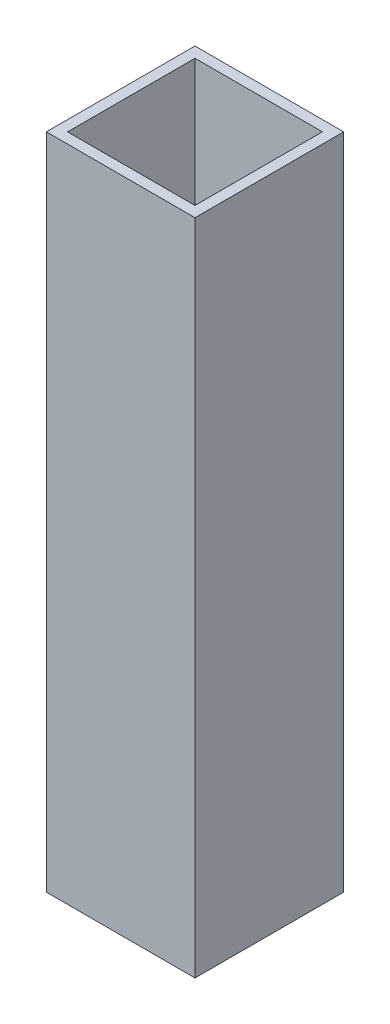
ISO-10303-21;
HEADER;
FILE_DESCRIPTION(('STEP AP214'),'2;1');
FILE_NAME('part.step','',(''),(''),'','','');
FILE_SCHEMA(('AUTOMOTIVE_DESIGN { 1 0 10303 214 1 1 1 1 }'));
ENDSEC;
DATA;
#1=APPLICATION_CONTEXT('core data for automotive mechanical design processes');
#2=APPLICATION_PROTOCOL_DEFINITION('international standard','automotive_design',2000,#1);
#3=PRODUCT_CONTEXT('',#1,'mechanical');
#4=PRODUCT('Part','Part','',(#3));
#5=PRODUCT_RELATED_PRODUCT_CATEGORY('part','',(#4));
#6=PRODUCT_DEFINITION_FORMATION('','',#4);
#7=PRODUCT_DEFINITION_CONTEXT('part definition',#1,'design');
#8=PRODUCT_DEFINITION('design','',#6,#7);
#9=PRODUCT_DEFINITION_SHAPE('','',#8);
#10=(LENGTH_UNIT() NAMED_UNIT(*) SI_UNIT(.MILLI.,.METRE.));
#11=(NAMED_UNIT(*) PLANE_ANGLE_UNIT() SI_UNIT($,.RADIAN.));
#12=(NAMED_UNIT(*) SI_UNIT($,.STERADIAN.) SOLID_ANGLE_UNIT());
#13=UNCERTAINTY_MEASURE_WITH_UNIT(LENGTH_MEASURE(1.E-05),#10,'distance_accuracy_value','');
#14=(GEOMETRIC_REPRESENTATION_CONTEXT(3) GLOBAL_UNCERTAINTY_ASSIGNED_CONTEXT((#13)) GLOBAL_UNIT_ASSIGNED_CONTEXT((#10,
#11,#12)) REPRESENTATION_CONTEXT('',''));
#15=CARTESIAN_POINT('',(0.,0.,0.));
#16=DIRECTION('',(0.,0.,1.));
#17=DIRECTION('',(1.,0.,0.));
#18=AXIS2_PLACEMENT_3D('',#15,#16,#17);
#19=CARTESIAN_POINT('',(0.,196.85,0.));
#20=DIRECTION('',(0.,-1.,0.));
#21=DIRECTION('',(0.,0.,-1.));
#22=AXIS2_PLACEMENT_3D('',#19,#20,#21);
#23=PLANE('',#22);
#24=DIRECTION('',(0.,0.,1.));
#25=VECTOR('',#24,1.);
#26=CARTESIAN_POINT('',(0.,196.85,0.));
#27=LINE('',#26,#25);
#28=CARTESIAN_POINT('',(0.,196.85,-44.45));
#29=VERTEX_POINT('',#28);
#30=CARTESIAN_POINT('',(0.,196.85,0.));
#31=VERTEX_POINT('',#30);
#32=EDGE_CURVE('E138',#29,#31,#27,.T.);
#33=ORIENTED_EDGE('',*,*,#32,.T.);
#34=DIRECTION('',(1.,0.,0.));
#35=VECTOR('',#34,1.);
#36=CARTESIAN_POINT('',(0.,196.85,0.));
#37=LINE('',#36,#35);
#38=CARTESIAN_POINT('',(44.45,196.85,0.));
#39=VERTEX_POINT('',#38);
#40=EDGE_CURVE('E141',#31,#39,#37,.T.);
#41=ORIENTED_EDGE('',*,*,#40,.T.);
#42=DIRECTION('',(0.,0.,-1.));
#43=VECTOR('',#42,1.);
#44=CARTESIAN_POINT('',(44.45,196.85,0.));
#45=LINE('',#44,#43);
#46=CARTESIAN_POINT('',(44.45,196.85,-44.45));
#47=VERTEX_POINT('',#46);
#48=EDGE_CURVE('E144',#39,#47,#45,.T.);
#49=ORIENTED_EDGE('',*,*,#48,.T.);
#50=DIRECTION('',(-1.,0.,0.));
#51=VECTOR('',#50,1.);
#52=CARTESIAN_POINT('',(0.,196.85,-44.45));
#53=LINE('',#52,#51);
#54=EDGE_CURVE('E146',#47,#29,#53,.T.);
#55=ORIENTED_EDGE('',*,*,#54,.T.);
#56=EDGE_LOOP('',(#33,#41,#49,#55));
#57=FACE_BOUND('',#56,.T.);
#58=DIRECTION('',(1.,0.,0.));
#59=VECTOR('',#58,1.);
#60=CARTESIAN_POINT('',(3.175,196.85,-3.175));
#61=LINE('',#60,#59);
#62=CARTESIAN_POINT('',(3.175,196.85,-3.175));
#63=VERTEX_POINT('',#62);
#64=CARTESIAN_POINT('',(41.275,196.85,-3.175));
#65=VERTEX_POINT('',#64);
#66=EDGE_CURVE('E102',#63,#65,#61,.T.);
#67=ORIENTED_EDGE('',*,*,#66,.F.);
#68=DIRECTION('',(0.,0.,1.));
#69=VECTOR('',#68,1.);
#70=CARTESIAN_POINT('',(3.175,196.85,-3.175));
#71=LINE('',#70,#69);
#72=CARTESIAN_POINT('',(3.175,196.85,-41.275));
#73=VERTEX_POINT('',#72);
#74=EDGE_CURVE('E124',#73,#63,#71,.T.);
#75=ORIENTED_EDGE('',*,*,#74,.F.);
#76=DIRECTION('',(-1.,0.,0.));
#77=VECTOR('',#76,1.);
#78=CARTESIAN_POINT('',(3.175,196.85,-41.275));
#79=LINE('',#78,#77);
#80=CARTESIAN_POINT('',(41.275,196.85,-41.275));
#81=VERTEX_POINT('',#80);
#82=EDGE_CURVE('E122',#81,#73,#79,.T.);
#83=ORIENTED_EDGE('',*,*,#82,.F.);
#84=DIRECTION('',(0.,0.,-1.));
#85=VECTOR('',#84,1.);
#86=CARTESIAN_POINT('',(41.275,196.85,-3.175));
#87=LINE('',#86,#85);
#88=EDGE_CURVE('E110',#65,#81,#87,.T.);
#89=ORIENTED_EDGE('',*,*,#88,.F.);
#90=EDGE_LOOP('',(#67,#75,#83,#89));
#91=FACE_BOUND('',#90,.T.);
#92=ADVANCED_FACE('F37',(#57,#91),#23,.F.);
#93=CARTESIAN_POINT('',(0.,0.,0.));
#94=DIRECTION('',(0.,-1.,0.));
#95=DIRECTION('',(0.,0.,-1.));
#96=AXIS2_PLACEMENT_3D('',#93,#94,#95);
#97=PLANE('',#96);
#98=DIRECTION('',(0.,0.,1.));
#99=VECTOR('',#98,1.);
#100=CARTESIAN_POINT('',(0.,0.,0.));
#101=LINE('',#100,#99);
#102=CARTESIAN_POINT('',(0.,0.,-44.45));
#103=VERTEX_POINT('',#102);
#104=CARTESIAN_POINT('',(0.,0.,0.));
#105=VERTEX_POINT('',#104);
#106=EDGE_CURVE('E118',#103,#105,#101,.T.);
#107=ORIENTED_EDGE('',*,*,#106,.F.);
#108=DIRECTION('',(-1.,0.,0.));
#109=VECTOR('',#108,1.);
#110=CARTESIAN_POINT('',(0.,0.,-44.45));
#111=LINE('',#110,#109);
#112=CARTESIAN_POINT('',(44.45,0.,-44.45));
#113=VERTEX_POINT('',#112);
#114=EDGE_CURVE('E142',#113,#103,#111,.T.);
#115=ORIENTED_EDGE('',*,*,#114,.F.);
#116=DIRECTION('',(0.,0.,-1.));
#117=VECTOR('',#116,1.);
#118=CARTESIAN_POINT('',(44.45,0.,0.));
#119=LINE('',#118,#117);
#120=CARTESIAN_POINT('',(44.45,0.,0.));
#121=VERTEX_POINT('',#120);
#122=EDGE_CURVE('E153',#121,#113,#119,.T.);
#123=ORIENTED_EDGE('',*,*,#122,.F.);
#124=DIRECTION('',(1.,0.,0.));
#125=VECTOR('',#124,1.);
#126=CARTESIAN_POINT('',(0.,0.,0.));
#127=LINE('',#126,#125);
#128=EDGE_CURVE('E151',#105,#121,#127,.T.);
#129=ORIENTED_EDGE('',*,*,#128,.F.);
#130=EDGE_LOOP('',(#107,#115,#123,#129));
#131=FACE_BOUND('',#130,.T.);
#132=DIRECTION('',(0.,0.,1.));
#133=VECTOR('',#132,1.);
#134=CARTESIAN_POINT('',(3.175,0.,-3.175));
#135=LINE('',#134,#133);
#136=CARTESIAN_POINT('',(3.175,0.,-41.275));
#137=VERTEX_POINT('',#136);
#138=CARTESIAN_POINT('',(3.175,0.,-3.175));
#139=VERTEX_POINT('',#138);
#140=EDGE_CURVE('E111',#137,#139,#135,.T.);
#141=ORIENTED_EDGE('',*,*,#140,.T.);
#142=DIRECTION('',(1.,0.,0.));
#143=VECTOR('',#142,1.);
#144=CARTESIAN_POINT('',(3.175,0.,-3.175));
#145=LINE('',#144,#143);
#146=CARTESIAN_POINT('',(41.275,0.,-3.175));
#147=VERTEX_POINT('',#146);
#148=EDGE_CURVE('E60',#139,#147,#145,.T.);
#149=ORIENTED_EDGE('',*,*,#148,.T.);
#150=DIRECTION('',(0.,0.,-1.));
#151=VECTOR('',#150,1.);
#152=CARTESIAN_POINT('',(41.275,0.,-3.175));
#153=LINE('',#152,#151);
#154=CARTESIAN_POINT('',(41.275,0.,-41.275));
#155=VERTEX_POINT('',#154);
#156=EDGE_CURVE('E117',#147,#155,#153,.T.);
#157=ORIENTED_EDGE('',*,*,#156,.T.);
#158=DIRECTION('',(-1.,0.,0.));
#159=VECTOR('',#158,1.);
#160=CARTESIAN_POINT('',(3.175,0.,-41.275));
#161=LINE('',#160,#159);
#162=EDGE_CURVE('E130',#155,#137,#161,.T.);
#163=ORIENTED_EDGE('',*,*,#162,.T.);
#164=EDGE_LOOP('',(#141,#149,#157,#163));
#165=FACE_BOUND('',#164,.T.);
#166=ADVANCED_FACE('F171',(#131,#165),#97,.T.);
#167=CARTESIAN_POINT('',(0.,196.85,0.));
#168=DIRECTION('',(1.,0.,0.));
#169=DIRECTION('',(0.,0.,-1.));
#170=AXIS2_PLACEMENT_3D('',#167,#168,#169);
#171=PLANE('',#170);
#172=ORIENTED_EDGE('',*,*,#106,.T.);
#173=DIRECTION('',(0.,-1.,0.));
#174=VECTOR('',#173,1.);
#175=CARTESIAN_POINT('',(0.,196.85,0.));
#176=LINE('',#175,#174);
#177=EDGE_CURVE('E11',#31,#105,#176,.T.);
#178=ORIENTED_EDGE('',*,*,#177,.F.);
#179=ORIENTED_EDGE('',*,*,#32,.F.);
#180=DIRECTION('',(0.,-1.,0.));
#181=VECTOR('',#180,1.);
#182=CARTESIAN_POINT('',(0.,196.85,-44.45));
#183=LINE('',#182,#181);
#184=EDGE_CURVE('E148',#29,#103,#183,.T.);
#185=ORIENTED_EDGE('',*,*,#184,.T.);
#186=EDGE_LOOP('',(#172,#178,#179,#185));
#187=FACE_BOUND('',#186,.T.);
#188=ADVANCED_FACE('F39',(#187),#171,.F.);
#189=CARTESIAN_POINT('',(0.,196.85,0.));
#190=DIRECTION('',(0.,0.,-1.));
#191=DIRECTION('',(-1.,0.,0.));
#192=AXIS2_PLACEMENT_3D('',#189,#190,#191);
#193=PLANE('',#192);
#194=ORIENTED_EDGE('',*,*,#128,.T.);
#195=DIRECTION('',(0.,-1.,0.));
#196=VECTOR('',#195,1.);
#197=CARTESIAN_POINT('',(44.45,196.85,0.));
#198=LINE('',#197,#196);
#199=EDGE_CURVE('E45',#39,#121,#198,.T.);
#200=ORIENTED_EDGE('',*,*,#199,.F.);
#201=ORIENTED_EDGE('',*,*,#40,.F.);
#202=ORIENTED_EDGE('',*,*,#177,.T.);
#203=EDGE_LOOP('',(#194,#200,#201,#202));
#204=FACE_BOUND('',#203,.T.);
#205=ADVANCED_FACE('F181',(#204),#193,.F.);
#206=CARTESIAN_POINT('',(44.45,196.85,0.));
#207=DIRECTION('',(-1.,0.,0.));
#208=DIRECTION('',(0.,0.,1.));
#209=AXIS2_PLACEMENT_3D('',#206,#207,#208);
#210=PLANE('',#209);
#211=ORIENTED_EDGE('',*,*,#122,.T.);
#212=DIRECTION('',(0.,-1.,0.));
#213=VECTOR('',#212,1.);
#214=CARTESIAN_POINT('',(44.45,196.85,-44.45));
#215=LINE('',#214,#213);
#216=EDGE_CURVE('E158',#47,#113,#215,.T.);
#217=ORIENTED_EDGE('',*,*,#216,.F.);
#218=ORIENTED_EDGE('',*,*,#48,.F.);
#219=ORIENTED_EDGE('',*,*,#199,.T.);
#220=EDGE_LOOP('',(#211,#217,#218,#219));
#221=FACE_BOUND('',#220,.T.);
#222=ADVANCED_FACE('F165',(#221),#210,.F.);
#223=CARTESIAN_POINT('',(0.,196.85,-44.45));
#224=DIRECTION('',(0.,0.,1.));
#225=DIRECTION('',(1.,0.,0.));
#226=AXIS2_PLACEMENT_3D('',#223,#224,#225);
#227=PLANE('',#226);
#228=ORIENTED_EDGE('',*,*,#114,.T.);
#229=ORIENTED_EDGE('',*,*,#184,.F.);
#230=ORIENTED_EDGE('',*,*,#54,.F.);
#231=ORIENTED_EDGE('',*,*,#216,.T.);
#232=EDGE_LOOP('',(#228,#229,#230,#231));
#233=FACE_BOUND('',#232,.T.);
#234=ADVANCED_FACE('F175',(#233),#227,.F.);
#235=CARTESIAN_POINT('',(3.175,196.85,-3.175));
#236=DIRECTION('',(0.,0.,-1.));
#237=DIRECTION('',(-1.,0.,0.));
#238=AXIS2_PLACEMENT_3D('',#235,#236,#237);
#239=PLANE('',#238);
#240=ORIENTED_EDGE('',*,*,#148,.F.);
#241=DIRECTION('',(0.,-1.,0.));
#242=VECTOR('',#241,1.);
#243=CARTESIAN_POINT('',(3.175,196.85,-3.175));
#244=LINE('',#243,#242);
#245=EDGE_CURVE('E106',#63,#139,#244,.T.);
#246=ORIENTED_EDGE('',*,*,#245,.F.);
#247=ORIENTED_EDGE('',*,*,#66,.T.);
#248=DIRECTION('',(0.,-1.,0.));
#249=VECTOR('',#248,1.);
#250=CARTESIAN_POINT('',(41.275,196.85,-3.175));
#251=LINE('',#250,#249);
#252=EDGE_CURVE('E105',#65,#147,#251,.T.);
#253=ORIENTED_EDGE('',*,*,#252,.T.);
#254=EDGE_LOOP('',(#240,#246,#247,#253));
#255=FACE_BOUND('',#254,.T.);
#256=ADVANCED_FACE('F104',(#255),#239,.T.);
#257=CARTESIAN_POINT('',(41.275,196.85,-3.175));
#258=DIRECTION('',(-1.,0.,0.));
#259=DIRECTION('',(0.,0.,1.));
#260=AXIS2_PLACEMENT_3D('',#257,#258,#259);
#261=PLANE('',#260);
#262=ORIENTED_EDGE('',*,*,#156,.F.);
#263=ORIENTED_EDGE('',*,*,#252,.F.);
#264=ORIENTED_EDGE('',*,*,#88,.T.);
#265=DIRECTION('',(0.,-1.,0.));
#266=VECTOR('',#265,1.);
#267=CARTESIAN_POINT('',(41.275,196.85,-41.275));
#268=LINE('',#267,#266);
#269=EDGE_CURVE('E119',#81,#155,#268,.T.);
#270=ORIENTED_EDGE('',*,*,#269,.T.);
#271=EDGE_LOOP('',(#262,#263,#264,#270));
#272=FACE_BOUND('',#271,.T.);
#273=ADVANCED_FACE('F114',(#272),#261,.T.);
#274=CARTESIAN_POINT('',(3.175,196.85,-41.275));
#275=DIRECTION('',(0.,0.,1.));
#276=DIRECTION('',(1.,0.,0.));
#277=AXIS2_PLACEMENT_3D('',#274,#275,#276);
#278=PLANE('',#277);
#279=ORIENTED_EDGE('',*,*,#162,.F.);
#280=ORIENTED_EDGE('',*,*,#269,.F.);
#281=ORIENTED_EDGE('',*,*,#82,.T.);
#282=DIRECTION('',(0.,-1.,0.));
#283=VECTOR('',#282,1.);
#284=CARTESIAN_POINT('',(3.175,196.85,-41.275));
#285=LINE('',#284,#283);
#286=EDGE_CURVE('E52',#73,#137,#285,.T.);
#287=ORIENTED_EDGE('',*,*,#286,.T.);
#288=EDGE_LOOP('',(#279,#280,#281,#287));
#289=FACE_BOUND('',#288,.T.);
#290=ADVANCED_FACE('F204',(#289),#278,.T.);
#291=CARTESIAN_POINT('',(3.175,196.85,-3.175));
#292=DIRECTION('',(1.,0.,0.));
#293=DIRECTION('',(0.,0.,-1.));
#294=AXIS2_PLACEMENT_3D('',#291,#292,#293);
#295=PLANE('',#294);
#296=ORIENTED_EDGE('',*,*,#140,.F.);
#297=ORIENTED_EDGE('',*,*,#286,.F.);
#298=ORIENTED_EDGE('',*,*,#74,.T.);
#299=ORIENTED_EDGE('',*,*,#245,.T.);
#300=EDGE_LOOP('',(#296,#297,#298,#299));
#301=FACE_BOUND('',#300,.T.);
#302=ADVANCED_FACE('F208',(#301),#295,.T.);
#303=CLOSED_SHELL('',(#92,#166,#188,#205,#222,#234,#256,#273,#290,#302));
#304=MANIFOLD_SOLID_BREP('B2',#303);
#305=ADVANCED_BREP_SHAPE_REPRESENTATION('',(#18,#304),#14);
#306=SHAPE_DEFINITION_REPRESENTATION(#9,#305);
ENDSEC;
END-ISO-10303-21;
